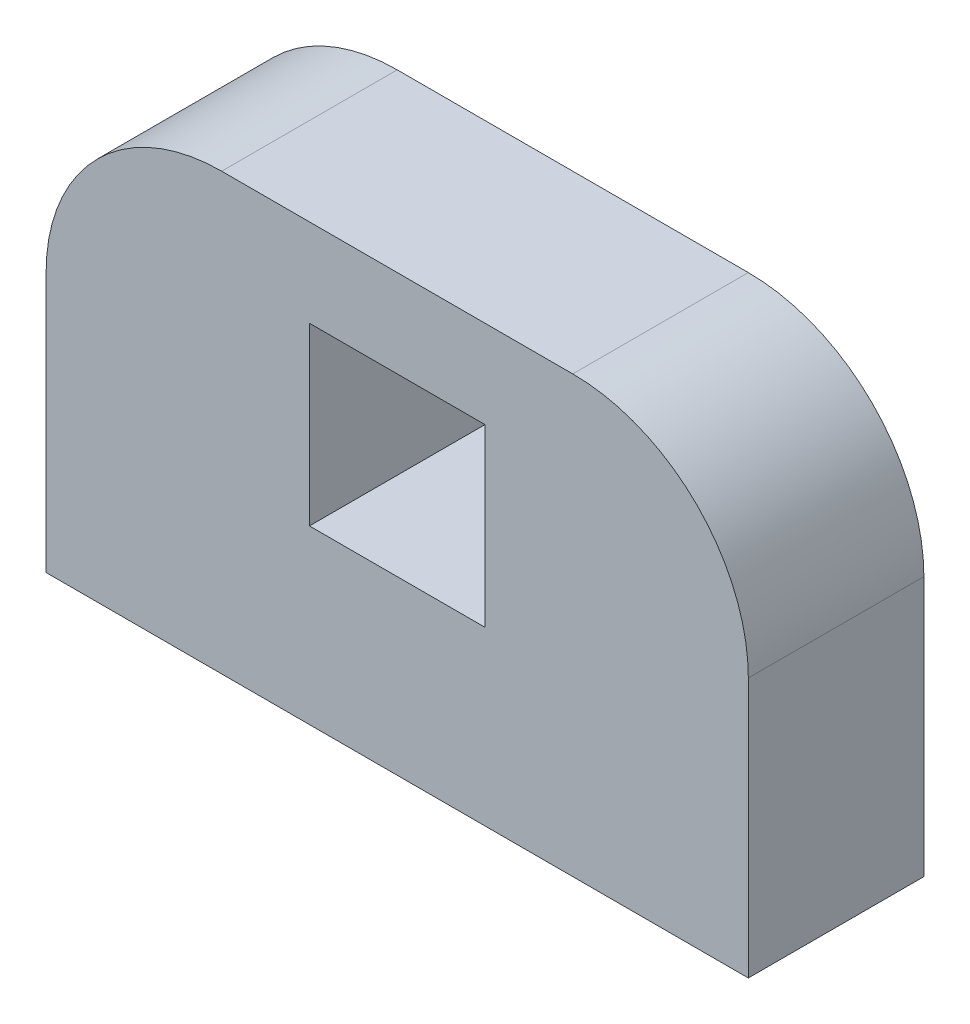
ISO-10303-21;
HEADER;
FILE_DESCRIPTION(('STEP AP214'),'2;1');
FILE_NAME('part.step','',(''),(''),'','','');
FILE_SCHEMA(('AUTOMOTIVE_DESIGN { 1 0 10303 214 1 1 1 1 }'));
ENDSEC;
DATA;
#1=APPLICATION_CONTEXT('core data for automotive mechanical design processes');
#2=APPLICATION_PROTOCOL_DEFINITION('international standard','automotive_design',2000,#1);
#3=PRODUCT_CONTEXT('',#1,'mechanical');
#4=PRODUCT('Part','Part','',(#3));
#5=PRODUCT_RELATED_PRODUCT_CATEGORY('part','',(#4));
#6=PRODUCT_DEFINITION_FORMATION('','',#4);
#7=PRODUCT_DEFINITION_CONTEXT('part definition',#1,'design');
#8=PRODUCT_DEFINITION('design','',#6,#7);
#9=PRODUCT_DEFINITION_SHAPE('','',#8);
#10=(LENGTH_UNIT() NAMED_UNIT(*) SI_UNIT(.MILLI.,.METRE.));
#11=(NAMED_UNIT(*) PLANE_ANGLE_UNIT() SI_UNIT($,.RADIAN.));
#12=(NAMED_UNIT(*) SI_UNIT($,.STERADIAN.) SOLID_ANGLE_UNIT());
#13=UNCERTAINTY_MEASURE_WITH_UNIT(LENGTH_MEASURE(1.E-05),#10,'distance_accuracy_value','');
#14=(GEOMETRIC_REPRESENTATION_CONTEXT(3) GLOBAL_UNCERTAINTY_ASSIGNED_CONTEXT((#13)) GLOBAL_UNIT_ASSIGNED_CONTEXT((#10,
#11,#12)) REPRESENTATION_CONTEXT('',''));
#15=CARTESIAN_POINT('',(0.,0.,0.));
#16=DIRECTION('',(0.,0.,1.));
#17=DIRECTION('',(1.,0.,0.));
#18=AXIS2_PLACEMENT_3D('',#15,#16,#17);
#19=CARTESIAN_POINT('',(3.175,4.699,3.175));
#20=DIRECTION('',(0.,0.,-1.));
#21=DIRECTION('',(-1.,0.,0.));
#22=AXIS2_PLACEMENT_3D('',#19,#20,#21);
#23=PLANE('',#22);
#24=DIRECTION('',(0.,-1.,0.));
#25=VECTOR('',#24,1.);
#26=CARTESIAN_POINT('',(0.,0.,3.175));
#27=LINE('',#26,#25);
#28=CARTESIAN_POINT('',(0.,4.69899999999998,3.175));
#29=VERTEX_POINT('',#28);
#30=CARTESIAN_POINT('',(0.,0.,3.175));
#31=VERTEX_POINT('',#30);
#32=EDGE_CURVE('E146',#29,#31,#27,.T.);
#33=ORIENTED_EDGE('',*,*,#32,.T.);
#34=DIRECTION('',(1.,0.,0.));
#35=VECTOR('',#34,1.);
#36=CARTESIAN_POINT('',(0.,0.,3.175));
#37=LINE('',#36,#35);
#38=CARTESIAN_POINT('',(12.7,0.,3.175));
#39=VERTEX_POINT('',#38);
#40=EDGE_CURVE('E149',#31,#39,#37,.T.);
#41=ORIENTED_EDGE('',*,*,#40,.T.);
#42=DIRECTION('',(0.,1.,0.));
#43=VECTOR('',#42,1.);
#44=CARTESIAN_POINT('',(12.7,0.,3.175));
#45=LINE('',#44,#43);
#46=CARTESIAN_POINT('',(12.7,4.69899999999998,3.175));
#47=VERTEX_POINT('',#46);
#48=EDGE_CURVE('E152',#39,#47,#45,.T.);
#49=ORIENTED_EDGE('',*,*,#48,.T.);
#50=CARTESIAN_POINT('',(9.525,4.699,3.175));
#51=DIRECTION('',(0.,0.,1.));
#52=DIRECTION('',(-1.,0.,0.));
#53=AXIS2_PLACEMENT_3D('',#50,#51,#52);
#54=CIRCLE('',#53,3.175);
#55=CARTESIAN_POINT('',(9.52499999999998,7.874,3.175));
#56=VERTEX_POINT('',#55);
#57=EDGE_CURVE('E154',#47,#56,#54,.T.);
#58=ORIENTED_EDGE('',*,*,#57,.T.);
#59=DIRECTION('',(-1.,0.,0.));
#60=VECTOR('',#59,1.);
#61=CARTESIAN_POINT('',(3.17500000000002,7.874,3.175));
#62=LINE('',#61,#60);
#63=CARTESIAN_POINT('',(3.17500000000002,7.874,3.175));
#64=VERTEX_POINT('',#63);
#65=EDGE_CURVE('E156',#56,#64,#62,.T.);
#66=ORIENTED_EDGE('',*,*,#65,.T.);
#67=CARTESIAN_POINT('',(3.175,4.699,3.175));
#68=DIRECTION('',(0.,0.,1.));
#69=DIRECTION('',(-1.,0.,0.));
#70=AXIS2_PLACEMENT_3D('',#67,#68,#69);
#71=CIRCLE('',#70,3.175);
#72=EDGE_CURVE('E158',#64,#29,#71,.T.);
#73=ORIENTED_EDGE('',*,*,#72,.T.);
#74=EDGE_LOOP('',(#33,#41,#49,#58,#66,#73));
#75=FACE_BOUND('',#74,.T.);
#76=DIRECTION('',(0.,-1.,0.));
#77=VECTOR('',#76,1.);
#78=CARTESIAN_POINT('',(4.7625,6.2865,3.175));
#79=LINE('',#78,#77);
#80=CARTESIAN_POINT('',(4.7625,6.2865,3.175));
#81=VERTEX_POINT('',#80);
#82=CARTESIAN_POINT('',(4.7625,3.1115,3.175));
#83=VERTEX_POINT('',#82);
#84=EDGE_CURVE('E110',#81,#83,#79,.T.);
#85=ORIENTED_EDGE('',*,*,#84,.F.);
#86=DIRECTION('',(-1.,0.,0.));
#87=VECTOR('',#86,1.);
#88=CARTESIAN_POINT('',(4.7625,6.2865,3.175));
#89=LINE('',#88,#87);
#90=CARTESIAN_POINT('',(7.9375,6.2865,3.175));
#91=VERTEX_POINT('',#90);
#92=EDGE_CURVE('E132',#91,#81,#89,.T.);
#93=ORIENTED_EDGE('',*,*,#92,.F.);
#94=DIRECTION('',(0.,1.,0.));
#95=VECTOR('',#94,1.);
#96=CARTESIAN_POINT('',(7.9375,6.2865,3.175));
#97=LINE('',#96,#95);
#98=CARTESIAN_POINT('',(7.9375,3.1115,3.175));
#99=VERTEX_POINT('',#98);
#100=EDGE_CURVE('E130',#99,#91,#97,.T.);
#101=ORIENTED_EDGE('',*,*,#100,.F.);
#102=DIRECTION('',(1.,0.,0.));
#103=VECTOR('',#102,1.);
#104=CARTESIAN_POINT('',(4.7625,3.1115,3.175));
#105=LINE('',#104,#103);
#106=EDGE_CURVE('E118',#83,#99,#105,.T.);
#107=ORIENTED_EDGE('',*,*,#106,.F.);
#108=EDGE_LOOP('',(#85,#93,#101,#107));
#109=FACE_BOUND('',#108,.T.);
#110=ADVANCED_FACE('F33',(#75,#109),#23,.F.);
#111=CARTESIAN_POINT('',(3.175,4.699,0.));
#112=DIRECTION('',(0.,0.,-1.));
#113=DIRECTION('',(-1.,0.,0.));
#114=AXIS2_PLACEMENT_3D('',#111,#112,#113);
#115=PLANE('',#114);
#116=DIRECTION('',(0.,-1.,0.));
#117=VECTOR('',#116,1.);
#118=CARTESIAN_POINT('',(0.,0.,0.));
#119=LINE('',#118,#117);
#120=CARTESIAN_POINT('',(0.,4.69899999999998,0.));
#121=VERTEX_POINT('',#120);
#122=CARTESIAN_POINT('',(0.,0.,0.));
#123=VERTEX_POINT('',#122);
#124=EDGE_CURVE('E126',#121,#123,#119,.T.);
#125=ORIENTED_EDGE('',*,*,#124,.F.);
#126=CARTESIAN_POINT('',(3.175,4.699,0.));
#127=DIRECTION('',(0.,0.,1.));
#128=DIRECTION('',(-1.,0.,0.));
#129=AXIS2_PLACEMENT_3D('',#126,#127,#128);
#130=CIRCLE('',#129,3.175);
#131=CARTESIAN_POINT('',(3.17500000000002,7.874,0.));
#132=VERTEX_POINT('',#131);
#133=EDGE_CURVE('E150',#132,#121,#130,.T.);
#134=ORIENTED_EDGE('',*,*,#133,.F.);
#135=DIRECTION('',(-1.,0.,0.));
#136=VECTOR('',#135,1.);
#137=CARTESIAN_POINT('',(3.17500000000002,7.874,0.));
#138=LINE('',#137,#136);
#139=CARTESIAN_POINT('',(9.52499999999998,7.874,0.));
#140=VERTEX_POINT('',#139);
#141=EDGE_CURVE('E169',#140,#132,#138,.T.);
#142=ORIENTED_EDGE('',*,*,#141,.F.);
#143=CARTESIAN_POINT('',(9.525,4.699,0.));
#144=DIRECTION('',(0.,0.,1.));
#145=DIRECTION('',(-1.,0.,0.));
#146=AXIS2_PLACEMENT_3D('',#143,#144,#145);
#147=CIRCLE('',#146,3.175);
#148=CARTESIAN_POINT('',(12.7,4.69899999999998,0.));
#149=VERTEX_POINT('',#148);
#150=EDGE_CURVE('E167',#149,#140,#147,.T.);
#151=ORIENTED_EDGE('',*,*,#150,.F.);
#152=DIRECTION('',(0.,1.,0.));
#153=VECTOR('',#152,1.);
#154=CARTESIAN_POINT('',(12.7,0.,0.));
#155=LINE('',#154,#153);
#156=CARTESIAN_POINT('',(12.7,0.,0.));
#157=VERTEX_POINT('',#156);
#158=EDGE_CURVE('E165',#157,#149,#155,.T.);
#159=ORIENTED_EDGE('',*,*,#158,.F.);
#160=DIRECTION('',(1.,0.,0.));
#161=VECTOR('',#160,1.);
#162=CARTESIAN_POINT('',(0.,0.,0.));
#163=LINE('',#162,#161);
#164=EDGE_CURVE('E163',#123,#157,#163,.T.);
#165=ORIENTED_EDGE('',*,*,#164,.F.);
#166=EDGE_LOOP('',(#125,#134,#142,#151,#159,#165));
#167=FACE_BOUND('',#166,.T.);
#168=DIRECTION('',(-1.,0.,0.));
#169=VECTOR('',#168,1.);
#170=CARTESIAN_POINT('',(4.7625,6.2865,0.));
#171=LINE('',#170,#169);
#172=CARTESIAN_POINT('',(7.9375,6.2865,0.));
#173=VERTEX_POINT('',#172);
#174=CARTESIAN_POINT('',(4.7625,6.2865,0.));
#175=VERTEX_POINT('',#174);
#176=EDGE_CURVE('E119',#173,#175,#171,.T.);
#177=ORIENTED_EDGE('',*,*,#176,.T.);
#178=DIRECTION('',(0.,-1.,0.));
#179=VECTOR('',#178,1.);
#180=CARTESIAN_POINT('',(4.7625,6.2865,0.));
#181=LINE('',#180,#179);
#182=CARTESIAN_POINT('',(4.7625,3.1115,0.));
#183=VERTEX_POINT('',#182);
#184=EDGE_CURVE('E56',#175,#183,#181,.T.);
#185=ORIENTED_EDGE('',*,*,#184,.T.);
#186=DIRECTION('',(1.,0.,0.));
#187=VECTOR('',#186,1.);
#188=CARTESIAN_POINT('',(4.7625,3.1115,0.));
#189=LINE('',#188,#187);
#190=CARTESIAN_POINT('',(7.9375,3.1115,0.));
#191=VERTEX_POINT('',#190);
#192=EDGE_CURVE('E125',#183,#191,#189,.T.);
#193=ORIENTED_EDGE('',*,*,#192,.T.);
#194=DIRECTION('',(0.,1.,0.));
#195=VECTOR('',#194,1.);
#196=CARTESIAN_POINT('',(7.9375,6.2865,0.));
#197=LINE('',#196,#195);
#198=EDGE_CURVE('E138',#191,#173,#197,.T.);
#199=ORIENTED_EDGE('',*,*,#198,.T.);
#200=EDGE_LOOP('',(#177,#185,#193,#199));
#201=FACE_BOUND('',#200,.T.);
#202=ADVANCED_FACE('F193',(#167,#201),#115,.T.);
#203=CARTESIAN_POINT('',(0.,0.,3.175));
#204=DIRECTION('',(1.,0.,0.));
#205=DIRECTION('',(0.,0.,-1.));
#206=AXIS2_PLACEMENT_3D('',#203,#204,#205);
#207=PLANE('',#206);
#208=ORIENTED_EDGE('',*,*,#124,.T.);
#209=DIRECTION('',(0.,0.,-1.));
#210=VECTOR('',#209,1.);
#211=CARTESIAN_POINT('',(0.,0.,3.175));
#212=LINE('',#211,#210);
#213=EDGE_CURVE('E11',#31,#123,#212,.T.);
#214=ORIENTED_EDGE('',*,*,#213,.F.);
#215=ORIENTED_EDGE('',*,*,#32,.F.);
#216=DIRECTION('',(0.,0.,-1.));
#217=VECTOR('',#216,1.);
#218=CARTESIAN_POINT('',(0.,4.69899999999998,3.175));
#219=LINE('',#218,#217);
#220=EDGE_CURVE('E160',#29,#121,#219,.T.);
#221=ORIENTED_EDGE('',*,*,#220,.T.);
#222=EDGE_LOOP('',(#208,#214,#215,#221));
#223=FACE_BOUND('',#222,.T.);
#224=ADVANCED_FACE('F35',(#223),#207,.F.);
#225=CARTESIAN_POINT('',(0.,0.,3.175));
#226=DIRECTION('',(0.,1.,0.));
#227=DIRECTION('',(0.,0.,1.));
#228=AXIS2_PLACEMENT_3D('',#225,#226,#227);
#229=PLANE('',#228);
#230=ORIENTED_EDGE('',*,*,#164,.T.);
#231=DIRECTION('',(0.,0.,-1.));
#232=VECTOR('',#231,1.);
#233=CARTESIAN_POINT('',(12.7,0.,3.175));
#234=LINE('',#233,#232);
#235=EDGE_CURVE('E41',#39,#157,#234,.T.);
#236=ORIENTED_EDGE('',*,*,#235,.F.);
#237=ORIENTED_EDGE('',*,*,#40,.F.);
#238=ORIENTED_EDGE('',*,*,#213,.T.);
#239=EDGE_LOOP('',(#230,#236,#237,#238));
#240=FACE_BOUND('',#239,.T.);
#241=ADVANCED_FACE('F210',(#240),#229,.F.);
#242=CARTESIAN_POINT('',(12.7,0.,3.175));
#243=DIRECTION('',(-1.,0.,0.));
#244=DIRECTION('',(0.,0.,1.));
#245=AXIS2_PLACEMENT_3D('',#242,#243,#244);
#246=PLANE('',#245);
#247=ORIENTED_EDGE('',*,*,#158,.T.);
#248=DIRECTION('',(0.,0.,-1.));
#249=VECTOR('',#248,1.);
#250=CARTESIAN_POINT('',(12.7,4.69899999999998,3.175));
#251=LINE('',#250,#249);
#252=EDGE_CURVE('E180',#47,#149,#251,.T.);
#253=ORIENTED_EDGE('',*,*,#252,.F.);
#254=ORIENTED_EDGE('',*,*,#48,.F.);
#255=ORIENTED_EDGE('',*,*,#235,.T.);
#256=EDGE_LOOP('',(#247,#253,#254,#255));
#257=FACE_BOUND('',#256,.T.);
#258=ADVANCED_FACE('F187',(#257),#246,.F.);
#259=CARTESIAN_POINT('',(9.525,4.699,3.175));
#260=DIRECTION('',(0.,0.,-1.));
#261=DIRECTION('',(-1.,0.,0.));
#262=AXIS2_PLACEMENT_3D('',#259,#260,#261);
#263=CYLINDRICAL_SURFACE('',#262,3.175);
#264=ORIENTED_EDGE('',*,*,#150,.T.);
#265=DIRECTION('',(0.,0.,-1.));
#266=VECTOR('',#265,1.);
#267=CARTESIAN_POINT('',(9.52499999999998,7.874,3.175));
#268=LINE('',#267,#266);
#269=EDGE_CURVE('E177',#56,#140,#268,.T.);
#270=ORIENTED_EDGE('',*,*,#269,.F.);
#271=ORIENTED_EDGE('',*,*,#57,.F.);
#272=ORIENTED_EDGE('',*,*,#252,.T.);
#273=EDGE_LOOP('',(#264,#270,#271,#272));
#274=FACE_BOUND('',#273,.T.);
#275=ADVANCED_FACE('F199',(#274),#263,.T.);
#276=CARTESIAN_POINT('',(3.17500000000002,7.874,3.175));
#277=DIRECTION('',(0.,-1.,0.));
#278=DIRECTION('',(0.,0.,-1.));
#279=AXIS2_PLACEMENT_3D('',#276,#277,#278);
#280=PLANE('',#279);
#281=ORIENTED_EDGE('',*,*,#141,.T.);
#282=DIRECTION('',(0.,0.,-1.));
#283=VECTOR('',#282,1.);
#284=CARTESIAN_POINT('',(3.17500000000002,7.874,3.175));
#285=LINE('',#284,#283);
#286=EDGE_CURVE('E174',#64,#132,#285,.T.);
#287=ORIENTED_EDGE('',*,*,#286,.F.);
#288=ORIENTED_EDGE('',*,*,#65,.F.);
#289=ORIENTED_EDGE('',*,*,#269,.T.);
#290=EDGE_LOOP('',(#281,#287,#288,#289));
#291=FACE_BOUND('',#290,.T.);
#292=ADVANCED_FACE('F203',(#291),#280,.F.);
#293=CARTESIAN_POINT('',(3.175,4.699,3.175));
#294=DIRECTION('',(0.,0.,-1.));
#295=DIRECTION('',(-1.,0.,0.));
#296=AXIS2_PLACEMENT_3D('',#293,#294,#295);
#297=CYLINDRICAL_SURFACE('',#296,3.175);
#298=ORIENTED_EDGE('',*,*,#133,.T.);
#299=ORIENTED_EDGE('',*,*,#220,.F.);
#300=ORIENTED_EDGE('',*,*,#72,.F.);
#301=ORIENTED_EDGE('',*,*,#286,.T.);
#302=EDGE_LOOP('',(#298,#299,#300,#301));
#303=FACE_BOUND('',#302,.T.);
#304=ADVANCED_FACE('F213',(#303),#297,.T.);
#305=CARTESIAN_POINT('',(4.7625,6.2865,3.175));
#306=DIRECTION('',(1.,0.,0.));
#307=DIRECTION('',(0.,0.,-1.));
#308=AXIS2_PLACEMENT_3D('',#305,#306,#307);
#309=PLANE('',#308);
#310=ORIENTED_EDGE('',*,*,#184,.F.);
#311=DIRECTION('',(0.,0.,-1.));
#312=VECTOR('',#311,1.);
#313=CARTESIAN_POINT('',(4.7625,6.2865,3.175));
#314=LINE('',#313,#312);
#315=EDGE_CURVE('E114',#81,#175,#314,.T.);
#316=ORIENTED_EDGE('',*,*,#315,.F.);
#317=ORIENTED_EDGE('',*,*,#84,.T.);
#318=DIRECTION('',(0.,0.,-1.));
#319=VECTOR('',#318,1.);
#320=CARTESIAN_POINT('',(4.7625,3.1115,3.175));
#321=LINE('',#320,#319);
#322=EDGE_CURVE('E113',#83,#183,#321,.T.);
#323=ORIENTED_EDGE('',*,*,#322,.T.);
#324=EDGE_LOOP('',(#310,#316,#317,#323));
#325=FACE_BOUND('',#324,.T.);
#326=ADVANCED_FACE('F112',(#325),#309,.T.);
#327=CARTESIAN_POINT('',(4.7625,3.1115,3.175));
#328=DIRECTION('',(0.,1.,0.));
#329=DIRECTION('',(0.,0.,1.));
#330=AXIS2_PLACEMENT_3D('',#327,#328,#329);
#331=PLANE('',#330);
#332=ORIENTED_EDGE('',*,*,#192,.F.);
#333=ORIENTED_EDGE('',*,*,#322,.F.);
#334=ORIENTED_EDGE('',*,*,#106,.T.);
#335=DIRECTION('',(0.,0.,-1.));
#336=VECTOR('',#335,1.);
#337=CARTESIAN_POINT('',(7.9375,3.1115,3.175));
#338=LINE('',#337,#336);
#339=EDGE_CURVE('E127',#99,#191,#338,.T.);
#340=ORIENTED_EDGE('',*,*,#339,.T.);
#341=EDGE_LOOP('',(#332,#333,#334,#340));
#342=FACE_BOUND('',#341,.T.);
#343=ADVANCED_FACE('F122',(#342),#331,.T.);
#344=CARTESIAN_POINT('',(7.9375,6.2865,3.175));
#345=DIRECTION('',(-1.,0.,0.));
#346=DIRECTION('',(0.,0.,1.));
#347=AXIS2_PLACEMENT_3D('',#344,#345,#346);
#348=PLANE('',#347);
#349=ORIENTED_EDGE('',*,*,#198,.F.);
#350=ORIENTED_EDGE('',*,*,#339,.F.);
#351=ORIENTED_EDGE('',*,*,#100,.T.);
#352=DIRECTION('',(0.,0.,-1.));
#353=VECTOR('',#352,1.);
#354=CARTESIAN_POINT('',(7.9375,6.2865,3.175));
#355=LINE('',#354,#353);
#356=EDGE_CURVE('E48',#91,#173,#355,.T.);
#357=ORIENTED_EDGE('',*,*,#356,.T.);
#358=EDGE_LOOP('',(#349,#350,#351,#357));
#359=FACE_BOUND('',#358,.T.);
#360=ADVANCED_FACE('F231',(#359),#348,.T.);
#361=CARTESIAN_POINT('',(4.7625,6.2865,3.175));
#362=DIRECTION('',(0.,-1.,0.));
#363=DIRECTION('',(0.,0.,-1.));
#364=AXIS2_PLACEMENT_3D('',#361,#362,#363);
#365=PLANE('',#364);
#366=ORIENTED_EDGE('',*,*,#176,.F.);
#367=ORIENTED_EDGE('',*,*,#356,.F.);
#368=ORIENTED_EDGE('',*,*,#92,.T.);
#369=ORIENTED_EDGE('',*,*,#315,.T.);
#370=EDGE_LOOP('',(#366,#367,#368,#369));
#371=FACE_BOUND('',#370,.T.);
#372=ADVANCED_FACE('F234',(#371),#365,.T.);
#373=CLOSED_SHELL('',(#110,#202,#224,#241,#258,#275,#292,#304,#326,#343,#360,#372));
#374=MANIFOLD_SOLID_BREP('B2',#373);
#375=ADVANCED_BREP_SHAPE_REPRESENTATION('',(#18,#374),#14);
#376=SHAPE_DEFINITION_REPRESENTATION(#9,#375);
ENDSEC;
END-ISO-10303-21;
